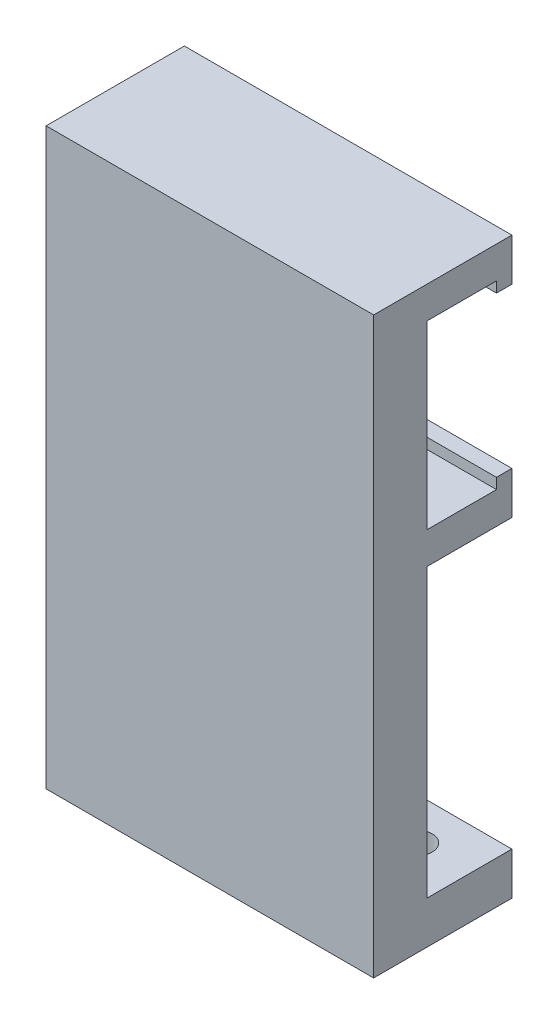
ISO-10303-21;
HEADER;
FILE_DESCRIPTION(('STEP AP214'),'2;1');
FILE_NAME('part.step','',(''),(''),'','','');
FILE_SCHEMA(('AUTOMOTIVE_DESIGN { 1 0 10303 214 1 1 1 1 }'));
ENDSEC;
DATA;
#1=APPLICATION_CONTEXT('core data for automotive mechanical design processes');
#2=APPLICATION_PROTOCOL_DEFINITION('international standard','automotive_design',2000,#1);
#3=PRODUCT_CONTEXT('',#1,'mechanical');
#4=PRODUCT('Part','Part','',(#3));
#5=PRODUCT_RELATED_PRODUCT_CATEGORY('part','',(#4));
#6=PRODUCT_DEFINITION_FORMATION('','',#4);
#7=PRODUCT_DEFINITION_CONTEXT('part definition',#1,'design');
#8=PRODUCT_DEFINITION('design','',#6,#7);
#9=PRODUCT_DEFINITION_SHAPE('','',#8);
#10=(LENGTH_UNIT() NAMED_UNIT(*) SI_UNIT(.MILLI.,.METRE.));
#11=(NAMED_UNIT(*) PLANE_ANGLE_UNIT() SI_UNIT($,.RADIAN.));
#12=(NAMED_UNIT(*) SI_UNIT($,.STERADIAN.) SOLID_ANGLE_UNIT());
#13=UNCERTAINTY_MEASURE_WITH_UNIT(LENGTH_MEASURE(1.E-05),#10,'distance_accuracy_value','');
#14=(GEOMETRIC_REPRESENTATION_CONTEXT(3) GLOBAL_UNCERTAINTY_ASSIGNED_CONTEXT((#13)) GLOBAL_UNIT_ASSIGNED_CONTEXT((#10,
#11,#12)) REPRESENTATION_CONTEXT('',''));
#15=CARTESIAN_POINT('',(0.,0.,0.));
#16=DIRECTION('',(0.,0.,1.));
#17=DIRECTION('',(1.,0.,0.));
#18=AXIS2_PLACEMENT_3D('',#15,#16,#17);
#19=CARTESIAN_POINT('',(0.,0.,0.));
#20=DIRECTION('',(0.,0.,1.));
#21=DIRECTION('',(1.,0.,0.));
#22=AXIS2_PLACEMENT_3D('',#19,#20,#21);
#23=PLANE('',#22);
#24=DIRECTION('',(0.,1.,0.));
#25=VECTOR('',#24,1.);
#26=CARTESIAN_POINT('',(-2.5,-18.,0.));
#27=LINE('',#26,#25);
#28=CARTESIAN_POINT('',(-2.5,-18.,0.));
#29=VERTEX_POINT('',#28);
#30=CARTESIAN_POINT('',(-2.5,4.,0.));
#31=VERTEX_POINT('',#30);
#32=EDGE_CURVE('E412',#29,#31,#27,.T.);
#33=ORIENTED_EDGE('',*,*,#32,.F.);
#34=DIRECTION('',(-1.,0.,0.));
#35=VECTOR('',#34,1.);
#36=CARTESIAN_POINT('',(2.5,-18.,0.));
#37=LINE('',#36,#35);
#38=CARTESIAN_POINT('',(2.5,-18.,0.));
#39=VERTEX_POINT('',#38);
#40=EDGE_CURVE('E410',#39,#29,#37,.T.);
#41=ORIENTED_EDGE('',*,*,#40,.F.);
#42=DIRECTION('',(0.,-1.,0.));
#43=VECTOR('',#42,1.);
#44=CARTESIAN_POINT('',(2.5,-18.,0.));
#45=LINE('',#44,#43);
#46=CARTESIAN_POINT('',(2.5,4.,0.));
#47=VERTEX_POINT('',#46);
#48=EDGE_CURVE('E409',#47,#39,#45,.T.);
#49=ORIENTED_EDGE('',*,*,#48,.F.);
#50=DIRECTION('',(-1.,0.,0.));
#51=VECTOR('',#50,1.);
#52=CARTESIAN_POINT('',(15.4,4.,0.));
#53=LINE('',#52,#51);
#54=CARTESIAN_POINT('',(15.4,4.,0.));
#55=VERTEX_POINT('',#54);
#56=EDGE_CURVE('E197',#55,#47,#53,.T.);
#57=ORIENTED_EDGE('',*,*,#56,.F.);
#58=DIRECTION('',(0.,1.,0.));
#59=VECTOR('',#58,1.);
#60=CARTESIAN_POINT('',(15.4,27.,0.));
#61=LINE('',#60,#59);
#62=CARTESIAN_POINT('',(15.4,-23.,0.));
#63=VERTEX_POINT('',#62);
#64=EDGE_CURVE('E311',#63,#55,#61,.T.);
#65=ORIENTED_EDGE('',*,*,#64,.F.);
#66=DIRECTION('',(1.,0.,0.));
#67=VECTOR('',#66,1.);
#68=CARTESIAN_POINT('',(-15.4,-23.,0.));
#69=LINE('',#68,#67);
#70=CARTESIAN_POINT('',(-15.4,-23.,0.));
#71=VERTEX_POINT('',#70);
#72=EDGE_CURVE('E257',#71,#63,#69,.T.);
#73=ORIENTED_EDGE('',*,*,#72,.F.);
#74=DIRECTION('',(0.,-1.,0.));
#75=VECTOR('',#74,1.);
#76=CARTESIAN_POINT('',(-15.4,27.,0.));
#77=LINE('',#76,#75);
#78=CARTESIAN_POINT('',(-15.4,4.,0.));
#79=VERTEX_POINT('',#78);
#80=EDGE_CURVE('E315',#79,#71,#77,.T.);
#81=ORIENTED_EDGE('',*,*,#80,.F.);
#82=EDGE_CURVE('E62',#31,#79,#53,.T.);
#83=ORIENTED_EDGE('',*,*,#82,.F.);
#84=EDGE_LOOP('',(#33,#41,#49,#57,#65,#73,#81,#83));
#85=FACE_BOUND('',#84,.T.);
#86=ADVANCED_FACE('F39',(#85),#23,.F.);
#87=CARTESIAN_POINT('',(15.4,4.,-8.));
#88=DIRECTION('',(0.,1.,0.));
#89=DIRECTION('',(0.,0.,1.));
#90=AXIS2_PLACEMENT_3D('',#87,#88,#89);
#91=PLANE('',#90);
#92=DIRECTION('',(0.,0.,1.));
#93=VECTOR('',#92,1.);
#94=CARTESIAN_POINT('',(-2.5,4.,-8.));
#95=LINE('',#94,#93);
#96=CARTESIAN_POINT('',(-2.5,4.,-8.));
#97=VERTEX_POINT('',#96);
#98=EDGE_CURVE('E55',#97,#31,#95,.T.);
#99=ORIENTED_EDGE('',*,*,#98,.T.);
#100=ORIENTED_EDGE('',*,*,#82,.T.);
#101=DIRECTION('',(0.,0.,1.));
#102=VECTOR('',#101,1.);
#103=CARTESIAN_POINT('',(-15.4,4.,-8.));
#104=LINE('',#103,#102);
#105=CARTESIAN_POINT('',(-15.4,4.,-8.));
#106=VERTEX_POINT('',#105);
#107=EDGE_CURVE('E205',#106,#79,#104,.T.);
#108=ORIENTED_EDGE('',*,*,#107,.F.);
#109=DIRECTION('',(-1.,0.,0.));
#110=VECTOR('',#109,1.);
#111=CARTESIAN_POINT('',(15.4,4.,-8.));
#112=LINE('',#111,#110);
#113=EDGE_CURVE('E206',#97,#106,#112,.T.);
#114=ORIENTED_EDGE('',*,*,#113,.F.);
#115=EDGE_LOOP('',(#99,#100,#108,#114));
#116=FACE_BOUND('',#115,.T.);
#117=ADVANCED_FACE('F477',(#116),#91,.F.);
#118=DIRECTION('',(0.,0.,1.));
#119=VECTOR('',#118,1.);
#120=CARTESIAN_POINT('',(2.5,4.,-8.));
#121=LINE('',#120,#119);
#122=CARTESIAN_POINT('',(2.5,4.,-8.));
#123=VERTEX_POINT('',#122);
#124=EDGE_CURVE('E180',#123,#47,#121,.T.);
#125=ORIENTED_EDGE('',*,*,#124,.F.);
#126=CARTESIAN_POINT('',(15.4,4.,-8.));
#127=VERTEX_POINT('',#126);
#128=EDGE_CURVE('E195',#127,#123,#112,.T.);
#129=ORIENTED_EDGE('',*,*,#128,.F.);
#130=DIRECTION('',(0.,0.,1.));
#131=VECTOR('',#130,1.);
#132=CARTESIAN_POINT('',(15.4,4.,-8.));
#133=LINE('',#132,#131);
#134=EDGE_CURVE('E210',#127,#55,#133,.T.);
#135=ORIENTED_EDGE('',*,*,#134,.T.);
#136=ORIENTED_EDGE('',*,*,#56,.T.);
#137=EDGE_LOOP('',(#125,#129,#135,#136));
#138=FACE_BOUND('',#137,.T.);
#139=ADVANCED_FACE('F194',(#138),#91,.F.);
#140=CARTESIAN_POINT('',(15.4,24.,-8.));
#141=DIRECTION('',(0.,1.,0.));
#142=DIRECTION('',(0.,0.,1.));
#143=AXIS2_PLACEMENT_3D('',#140,#141,#142);
#144=PLANE('',#143);
#145=DIRECTION('',(-1.,0.,0.));
#146=VECTOR('',#145,1.);
#147=CARTESIAN_POINT('',(15.4,24.,-6.55));
#148=LINE('',#147,#146);
#149=CARTESIAN_POINT('',(15.4,24.,-6.55));
#150=VERTEX_POINT('',#149);
#151=CARTESIAN_POINT('',(-15.4,24.,-6.55));
#152=VERTEX_POINT('',#151);
#153=EDGE_CURVE('E362',#150,#152,#148,.T.);
#154=ORIENTED_EDGE('',*,*,#153,.F.);
#155=DIRECTION('',(0.,0.,1.));
#156=VECTOR('',#155,1.);
#157=CARTESIAN_POINT('',(15.4,24.,-8.));
#158=LINE('',#157,#156);
#159=CARTESIAN_POINT('',(15.4,24.,0.));
#160=VERTEX_POINT('',#159);
#161=EDGE_CURVE('E249',#150,#160,#158,.T.);
#162=ORIENTED_EDGE('',*,*,#161,.T.);
#163=DIRECTION('',(-1.,0.,0.));
#164=VECTOR('',#163,1.);
#165=CARTESIAN_POINT('',(15.4,24.,0.));
#166=LINE('',#165,#164);
#167=CARTESIAN_POINT('',(-15.4,24.,0.));
#168=VERTEX_POINT('',#167);
#169=EDGE_CURVE('E231',#160,#168,#166,.T.);
#170=ORIENTED_EDGE('',*,*,#169,.T.);
#171=DIRECTION('',(0.,0.,1.));
#172=VECTOR('',#171,1.);
#173=CARTESIAN_POINT('',(-15.4,24.,-8.));
#174=LINE('',#173,#172);
#175=EDGE_CURVE('E243',#152,#168,#174,.T.);
#176=ORIENTED_EDGE('',*,*,#175,.F.);
#177=EDGE_LOOP('',(#154,#162,#170,#176));
#178=FACE_BOUND('',#177,.T.);
#179=ADVANCED_FACE('F436',(#178),#144,.F.);
#180=CARTESIAN_POINT('',(15.4,7.,-8.));
#181=DIRECTION('',(0.,-1.,0.));
#182=DIRECTION('',(0.,0.,-1.));
#183=AXIS2_PLACEMENT_3D('',#180,#181,#182);
#184=PLANE('',#183);
#185=DIRECTION('',(1.,0.,0.));
#186=VECTOR('',#185,1.);
#187=CARTESIAN_POINT('',(15.4,7.,-6.55));
#188=LINE('',#187,#186);
#189=CARTESIAN_POINT('',(-15.4,7.,-6.55));
#190=VERTEX_POINT('',#189);
#191=CARTESIAN_POINT('',(15.4,7.,-6.55));
#192=VERTEX_POINT('',#191);
#193=EDGE_CURVE('E367',#190,#192,#188,.T.);
#194=ORIENTED_EDGE('',*,*,#193,.F.);
#195=DIRECTION('',(0.,0.,1.));
#196=VECTOR('',#195,1.);
#197=CARTESIAN_POINT('',(-15.4,7.,-8.));
#198=LINE('',#197,#196);
#199=CARTESIAN_POINT('',(-15.4,7.,0.));
#200=VERTEX_POINT('',#199);
#201=EDGE_CURVE('E228',#190,#200,#198,.T.);
#202=ORIENTED_EDGE('',*,*,#201,.T.);
#203=DIRECTION('',(1.,0.,0.));
#204=VECTOR('',#203,1.);
#205=CARTESIAN_POINT('',(15.4,7.,0.));
#206=LINE('',#205,#204);
#207=CARTESIAN_POINT('',(15.4,7.,0.));
#208=VERTEX_POINT('',#207);
#209=EDGE_CURVE('E215',#200,#208,#206,.T.);
#210=ORIENTED_EDGE('',*,*,#209,.T.);
#211=DIRECTION('',(0.,0.,1.));
#212=VECTOR('',#211,1.);
#213=CARTESIAN_POINT('',(15.4,7.,-8.));
#214=LINE('',#213,#212);
#215=EDGE_CURVE('E225',#192,#208,#214,.T.);
#216=ORIENTED_EDGE('',*,*,#215,.F.);
#217=EDGE_LOOP('',(#194,#202,#210,#216));
#218=FACE_BOUND('',#217,.T.);
#219=ADVANCED_FACE('F446',(#218),#184,.F.);
#220=ORIENTED_EDGE('',*,*,#209,.F.);
#221=EDGE_CURVE('E301',#168,#200,#77,.T.);
#222=ORIENTED_EDGE('',*,*,#221,.F.);
#223=ORIENTED_EDGE('',*,*,#169,.F.);
#224=EDGE_CURVE('E295',#208,#160,#61,.T.);
#225=ORIENTED_EDGE('',*,*,#224,.F.);
#226=EDGE_LOOP('',(#220,#222,#223,#225));
#227=FACE_BOUND('',#226,.T.);
#228=ADVANCED_FACE('F444',(#227),#23,.F.);
#229=CARTESIAN_POINT('',(15.4,27.,5.));
#230=DIRECTION('',(-1.,0.,0.));
#231=DIRECTION('',(0.,-1.,0.));
#232=AXIS2_PLACEMENT_3D('',#229,#230,#231);
#233=PLANE('',#232);
#234=DIRECTION('',(0.,0.,-1.));
#235=VECTOR('',#234,1.);
#236=CARTESIAN_POINT('',(15.4,-27.,5.));
#237=LINE('',#236,#235);
#238=CARTESIAN_POINT('',(15.4,-27.,5.));
#239=VERTEX_POINT('',#238);
#240=CARTESIAN_POINT('',(15.4,-27.,-8.));
#241=VERTEX_POINT('',#240);
#242=EDGE_CURVE('E310',#239,#241,#237,.T.);
#243=ORIENTED_EDGE('',*,*,#242,.T.);
#244=DIRECTION('',(0.,-1.,0.));
#245=VECTOR('',#244,1.);
#246=CARTESIAN_POINT('',(15.4,-27.,-8.));
#247=LINE('',#246,#245);
#248=CARTESIAN_POINT('',(15.4,-23.,-8.));
#249=VERTEX_POINT('',#248);
#250=EDGE_CURVE('E276',#249,#241,#247,.T.);
#251=ORIENTED_EDGE('',*,*,#250,.F.);
#252=DIRECTION('',(0.,0.,1.));
#253=VECTOR('',#252,1.);
#254=CARTESIAN_POINT('',(15.4,-23.,-8.));
#255=LINE('',#254,#253);
#256=EDGE_CURVE('E284',#249,#63,#255,.T.);
#257=ORIENTED_EDGE('',*,*,#256,.T.);
#258=ORIENTED_EDGE('',*,*,#64,.T.);
#259=ORIENTED_EDGE('',*,*,#134,.F.);
#260=DIRECTION('',(0.,-1.,0.));
#261=VECTOR('',#260,1.);
#262=CARTESIAN_POINT('',(15.4,7.,-8.));
#263=LINE('',#262,#261);
#264=CARTESIAN_POINT('',(15.4,8.,-8.));
#265=VERTEX_POINT('',#264);
#266=EDGE_CURVE('E202',#265,#127,#263,.T.);
#267=ORIENTED_EDGE('',*,*,#266,.F.);
#268=DIRECTION('',(0.,0.,-1.));
#269=VECTOR('',#268,1.);
#270=CARTESIAN_POINT('',(15.4,8.,-8.));
#271=LINE('',#270,#269);
#272=CARTESIAN_POINT('',(15.4,8.,-6.55));
#273=VERTEX_POINT('',#272);
#274=EDGE_CURVE('E368',#273,#265,#271,.T.);
#275=ORIENTED_EDGE('',*,*,#274,.F.);
#276=DIRECTION('',(0.,-1.,0.));
#277=VECTOR('',#276,1.);
#278=CARTESIAN_POINT('',(15.4,8.,-6.55));
#279=LINE('',#278,#277);
#280=EDGE_CURVE('E382',#273,#192,#279,.T.);
#281=ORIENTED_EDGE('',*,*,#280,.T.);
#282=ORIENTED_EDGE('',*,*,#215,.T.);
#283=ORIENTED_EDGE('',*,*,#224,.T.);
#284=ORIENTED_EDGE('',*,*,#161,.F.);
#285=DIRECTION('',(0.,1.,0.));
#286=VECTOR('',#285,1.);
#287=CARTESIAN_POINT('',(15.4,23.,-6.55));
#288=LINE('',#287,#286);
#289=CARTESIAN_POINT('',(15.4,23.,-6.55));
#290=VERTEX_POINT('',#289);
#291=EDGE_CURVE('E356',#290,#150,#288,.T.);
#292=ORIENTED_EDGE('',*,*,#291,.F.);
#293=DIRECTION('',(0.,0.,1.));
#294=VECTOR('',#293,1.);
#295=CARTESIAN_POINT('',(15.4,23.,-8.));
#296=LINE('',#295,#294);
#297=CARTESIAN_POINT('',(15.4,23.,-8.));
#298=VERTEX_POINT('',#297);
#299=EDGE_CURVE('E346',#298,#290,#296,.T.);
#300=ORIENTED_EDGE('',*,*,#299,.F.);
#301=DIRECTION('',(0.,-1.,0.));
#302=VECTOR('',#301,1.);
#303=CARTESIAN_POINT('',(15.4,27.,-8.));
#304=LINE('',#303,#302);
#305=CARTESIAN_POINT('',(15.4,27.,-8.));
#306=VERTEX_POINT('',#305);
#307=EDGE_CURVE('E232',#306,#298,#304,.T.);
#308=ORIENTED_EDGE('',*,*,#307,.F.);
#309=DIRECTION('',(0.,0.,-1.));
#310=VECTOR('',#309,1.);
#311=CARTESIAN_POINT('',(15.4,27.,5.));
#312=LINE('',#311,#310);
#313=CARTESIAN_POINT('',(15.4,27.,5.));
#314=VERTEX_POINT('',#313);
#315=EDGE_CURVE('E11',#314,#306,#312,.T.);
#316=ORIENTED_EDGE('',*,*,#315,.F.);
#317=DIRECTION('',(0.,1.,0.));
#318=VECTOR('',#317,1.);
#319=CARTESIAN_POINT('',(15.4,27.,5.));
#320=LINE('',#319,#318);
#321=EDGE_CURVE('E296',#239,#314,#320,.T.);
#322=ORIENTED_EDGE('',*,*,#321,.F.);
#323=EDGE_LOOP('',(#243,#251,#257,#258,#259,#267,#275,#281,#282,#283,#284,#292,#300,#308,#316,#322));
#324=FACE_BOUND('',#323,.T.);
#325=ADVANCED_FACE('F41',(#324),#233,.F.);
#326=CARTESIAN_POINT('',(-15.4,27.,5.));
#327=DIRECTION('',(0.,-1.,0.));
#328=DIRECTION('',(0.,0.,-1.));
#329=AXIS2_PLACEMENT_3D('',#326,#327,#328);
#330=PLANE('',#329);
#331=ORIENTED_EDGE('',*,*,#315,.T.);
#332=DIRECTION('',(1.,0.,0.));
#333=VECTOR('',#332,1.);
#334=CARTESIAN_POINT('',(15.4,27.,-8.));
#335=LINE('',#334,#333);
#336=CARTESIAN_POINT('',(-15.4,27.,-8.));
#337=VERTEX_POINT('',#336);
#338=EDGE_CURVE('E239',#337,#306,#335,.T.);
#339=ORIENTED_EDGE('',*,*,#338,.F.);
#340=DIRECTION('',(0.,0.,-1.));
#341=VECTOR('',#340,1.);
#342=CARTESIAN_POINT('',(-15.4,27.,5.));
#343=LINE('',#342,#341);
#344=CARTESIAN_POINT('',(-15.4,27.,5.));
#345=VERTEX_POINT('',#344);
#346=EDGE_CURVE('E48',#345,#337,#343,.T.);
#347=ORIENTED_EDGE('',*,*,#346,.F.);
#348=DIRECTION('',(-1.,0.,0.));
#349=VECTOR('',#348,1.);
#350=CARTESIAN_POINT('',(-15.4,27.,5.));
#351=LINE('',#350,#349);
#352=EDGE_CURVE('E300',#314,#345,#351,.T.);
#353=ORIENTED_EDGE('',*,*,#352,.F.);
#354=EDGE_LOOP('',(#331,#339,#347,#353));
#355=FACE_BOUND('',#354,.T.);
#356=ADVANCED_FACE('F339',(#355),#330,.F.);
#357=CARTESIAN_POINT('',(-15.4,27.,5.));
#358=DIRECTION('',(1.,0.,0.));
#359=DIRECTION('',(0.,1.,0.));
#360=AXIS2_PLACEMENT_3D('',#357,#358,#359);
#361=PLANE('',#360);
#362=ORIENTED_EDGE('',*,*,#346,.T.);
#363=DIRECTION('',(0.,1.,0.));
#364=VECTOR('',#363,1.);
#365=CARTESIAN_POINT('',(-15.4,27.,-8.));
#366=LINE('',#365,#364);
#367=CARTESIAN_POINT('',(-15.4,23.,-8.));
#368=VERTEX_POINT('',#367);
#369=EDGE_CURVE('E235',#368,#337,#366,.T.);
#370=ORIENTED_EDGE('',*,*,#369,.F.);
#371=DIRECTION('',(0.,0.,-1.));
#372=VECTOR('',#371,1.);
#373=CARTESIAN_POINT('',(-15.4,23.,-8.));
#374=LINE('',#373,#372);
#375=CARTESIAN_POINT('',(-15.4,23.,-6.55));
#376=VERTEX_POINT('',#375);
#377=EDGE_CURVE('E349',#376,#368,#374,.T.);
#378=ORIENTED_EDGE('',*,*,#377,.F.);
#379=DIRECTION('',(0.,1.,0.));
#380=VECTOR('',#379,1.);
#381=CARTESIAN_POINT('',(-15.4,23.,-6.55));
#382=LINE('',#381,#380);
#383=EDGE_CURVE('E351',#376,#152,#382,.T.);
#384=ORIENTED_EDGE('',*,*,#383,.T.);
#385=ORIENTED_EDGE('',*,*,#175,.T.);
#386=ORIENTED_EDGE('',*,*,#221,.T.);
#387=ORIENTED_EDGE('',*,*,#201,.F.);
#388=DIRECTION('',(0.,-1.,0.));
#389=VECTOR('',#388,1.);
#390=CARTESIAN_POINT('',(-15.4,8.,-6.55));
#391=LINE('',#390,#389);
#392=CARTESIAN_POINT('',(-15.4,8.,-6.55));
#393=VERTEX_POINT('',#392);
#394=EDGE_CURVE('E219',#393,#190,#391,.T.);
#395=ORIENTED_EDGE('',*,*,#394,.F.);
#396=DIRECTION('',(0.,0.,1.));
#397=VECTOR('',#396,1.);
#398=CARTESIAN_POINT('',(-15.4,8.,-8.));
#399=LINE('',#398,#397);
#400=CARTESIAN_POINT('',(-15.4,8.,-8.));
#401=VERTEX_POINT('',#400);
#402=EDGE_CURVE('E376',#401,#393,#399,.T.);
#403=ORIENTED_EDGE('',*,*,#402,.F.);
#404=DIRECTION('',(0.,1.,0.));
#405=VECTOR('',#404,1.);
#406=CARTESIAN_POINT('',(-15.4,7.,-8.));
#407=LINE('',#406,#405);
#408=EDGE_CURVE('E221',#106,#401,#407,.T.);
#409=ORIENTED_EDGE('',*,*,#408,.F.);
#410=ORIENTED_EDGE('',*,*,#107,.T.);
#411=ORIENTED_EDGE('',*,*,#80,.T.);
#412=DIRECTION('',(0.,0.,1.));
#413=VECTOR('',#412,1.);
#414=CARTESIAN_POINT('',(-15.4,-23.,-8.));
#415=LINE('',#414,#413);
#416=CARTESIAN_POINT('',(-15.4,-23.,-8.));
#417=VERTEX_POINT('',#416);
#418=EDGE_CURVE('E291',#417,#71,#415,.T.);
#419=ORIENTED_EDGE('',*,*,#418,.F.);
#420=DIRECTION('',(0.,1.,0.));
#421=VECTOR('',#420,1.);
#422=CARTESIAN_POINT('',(-15.4,-27.,-8.));
#423=LINE('',#422,#421);
#424=CARTESIAN_POINT('',(-15.4,-27.,-8.));
#425=VERTEX_POINT('',#424);
#426=EDGE_CURVE('E269',#425,#417,#423,.T.);
#427=ORIENTED_EDGE('',*,*,#426,.F.);
#428=DIRECTION('',(0.,0.,-1.));
#429=VECTOR('',#428,1.);
#430=CARTESIAN_POINT('',(-15.4,-27.,5.));
#431=LINE('',#430,#429);
#432=CARTESIAN_POINT('',(-15.4,-27.,5.));
#433=VERTEX_POINT('',#432);
#434=EDGE_CURVE('E321',#433,#425,#431,.T.);
#435=ORIENTED_EDGE('',*,*,#434,.F.);
#436=DIRECTION('',(0.,-1.,0.));
#437=VECTOR('',#436,1.);
#438=CARTESIAN_POINT('',(-15.4,27.,5.));
#439=LINE('',#438,#437);
#440=EDGE_CURVE('E304',#345,#433,#439,.T.);
#441=ORIENTED_EDGE('',*,*,#440,.F.);
#442=EDGE_LOOP('',(#362,#370,#378,#384,#385,#386,#387,#395,#403,#409,#410,#411,#419,#427,#435,#441));
#443=FACE_BOUND('',#442,.T.);
#444=ADVANCED_FACE('F327',(#443),#361,.F.);
#445=CARTESIAN_POINT('',(-15.4,-27.,5.));
#446=DIRECTION('',(0.,1.,0.));
#447=DIRECTION('',(0.,0.,1.));
#448=AXIS2_PLACEMENT_3D('',#445,#446,#447);
#449=PLANE('',#448);
#450=CARTESIAN_POINT('',(10.4,-27.,-4.));
#451=DIRECTION('',(0.,1.,0.));
#452=DIRECTION('',(-1.,0.,0.));
#453=AXIS2_PLACEMENT_3D('',#450,#451,#452);
#454=CIRCLE('',#453,1.5);
#455=CARTESIAN_POINT('',(8.9,-27.,-4.));
#456=VERTEX_POINT('',#455);
#457=EDGE_CURVE('E253',#456,#456,#454,.T.);
#458=ORIENTED_EDGE('',*,*,#457,.T.);
#459=EDGE_LOOP('',(#458));
#460=FACE_BOUND('',#459,.T.);
#461=CARTESIAN_POINT('',(-10.4,-27.,-4.));
#462=DIRECTION('',(0.,1.,0.));
#463=DIRECTION('',(-1.,0.,0.));
#464=AXIS2_PLACEMENT_3D('',#461,#462,#463);
#465=CIRCLE('',#464,1.5);
#466=CARTESIAN_POINT('',(-11.9,-27.,-4.));
#467=VERTEX_POINT('',#466);
#468=EDGE_CURVE('E262',#467,#467,#465,.T.);
#469=ORIENTED_EDGE('',*,*,#468,.T.);
#470=EDGE_LOOP('',(#469));
#471=FACE_BOUND('',#470,.T.);
#472=ORIENTED_EDGE('',*,*,#434,.T.);
#473=DIRECTION('',(-1.,0.,0.));
#474=VECTOR('',#473,1.);
#475=CARTESIAN_POINT('',(-15.4,-27.,-8.));
#476=LINE('',#475,#474);
#477=EDGE_CURVE('E280',#241,#425,#476,.T.);
#478=ORIENTED_EDGE('',*,*,#477,.F.);
#479=ORIENTED_EDGE('',*,*,#242,.F.);
#480=DIRECTION('',(1.,0.,0.));
#481=VECTOR('',#480,1.);
#482=CARTESIAN_POINT('',(-15.4,-27.,5.));
#483=LINE('',#482,#481);
#484=EDGE_CURVE('E307',#433,#239,#483,.T.);
#485=ORIENTED_EDGE('',*,*,#484,.F.);
#486=EDGE_LOOP('',(#472,#478,#479,#485));
#487=FACE_BOUND('',#486,.T.);
#488=ADVANCED_FACE('F462',(#460,#471,#487),#449,.F.);
#489=CARTESIAN_POINT('',(0.,0.,5.));
#490=DIRECTION('',(0.,0.,1.));
#491=DIRECTION('',(1.,0.,0.));
#492=AXIS2_PLACEMENT_3D('',#489,#490,#491);
#493=PLANE('',#492);
#494=ORIENTED_EDGE('',*,*,#321,.T.);
#495=ORIENTED_EDGE('',*,*,#352,.T.);
#496=ORIENTED_EDGE('',*,*,#440,.T.);
#497=ORIENTED_EDGE('',*,*,#484,.T.);
#498=EDGE_LOOP('',(#494,#495,#496,#497));
#499=FACE_BOUND('',#498,.T.);
#500=ADVANCED_FACE('F464',(#499),#493,.T.);
#501=CARTESIAN_POINT('',(-15.4,-23.,-8.));
#502=DIRECTION('',(0.,-1.,0.));
#503=DIRECTION('',(1.,0.,0.));
#504=AXIS2_PLACEMENT_3D('',#501,#502,#503);
#505=PLANE('',#504);
#506=CARTESIAN_POINT('',(10.4,-23.,-4.));
#507=DIRECTION('',(0.,1.,0.));
#508=DIRECTION('',(-1.,0.,0.));
#509=AXIS2_PLACEMENT_3D('',#506,#507,#508);
#510=CIRCLE('',#509,1.5);
#511=CARTESIAN_POINT('',(8.9,-23.,-4.));
#512=VERTEX_POINT('',#511);
#513=EDGE_CURVE('E258',#512,#512,#510,.T.);
#514=ORIENTED_EDGE('',*,*,#513,.F.);
#515=EDGE_LOOP('',(#514));
#516=FACE_BOUND('',#515,.T.);
#517=CARTESIAN_POINT('',(-10.4,-23.,-4.));
#518=DIRECTION('',(0.,1.,0.));
#519=DIRECTION('',(-1.,0.,0.));
#520=AXIS2_PLACEMENT_3D('',#517,#518,#519);
#521=CIRCLE('',#520,1.5);
#522=CARTESIAN_POINT('',(-11.9,-23.,-4.));
#523=VERTEX_POINT('',#522);
#524=EDGE_CURVE('E252',#523,#523,#521,.T.);
#525=ORIENTED_EDGE('',*,*,#524,.F.);
#526=EDGE_LOOP('',(#525));
#527=FACE_BOUND('',#526,.T.);
#528=ORIENTED_EDGE('',*,*,#72,.T.);
#529=ORIENTED_EDGE('',*,*,#256,.F.);
#530=DIRECTION('',(1.,0.,0.));
#531=VECTOR('',#530,1.);
#532=CARTESIAN_POINT('',(-15.4,-23.,-8.));
#533=LINE('',#532,#531);
#534=EDGE_CURVE('E273',#417,#249,#533,.T.);
#535=ORIENTED_EDGE('',*,*,#534,.F.);
#536=ORIENTED_EDGE('',*,*,#418,.T.);
#537=EDGE_LOOP('',(#528,#529,#535,#536));
#538=FACE_BOUND('',#537,.T.);
#539=ADVANCED_FACE('F454',(#516,#527,#538),#505,.F.);
#540=CARTESIAN_POINT('',(0.,0.,-8.));
#541=DIRECTION('',(0.,0.,-1.));
#542=DIRECTION('',(-1.,0.,0.));
#543=AXIS2_PLACEMENT_3D('',#540,#541,#542);
#544=PLANE('',#543);
#545=ORIENTED_EDGE('',*,*,#426,.T.);
#546=ORIENTED_EDGE('',*,*,#534,.T.);
#547=ORIENTED_EDGE('',*,*,#250,.T.);
#548=ORIENTED_EDGE('',*,*,#477,.T.);
#549=EDGE_LOOP('',(#545,#546,#547,#548));
#550=FACE_BOUND('',#549,.T.);
#551=ADVANCED_FACE('F457',(#550),#544,.T.);
#552=CARTESIAN_POINT('',(-10.4,-27.,-4.));
#553=DIRECTION('',(0.,1.,0.));
#554=DIRECTION('',(-1.,0.,0.));
#555=AXIS2_PLACEMENT_3D('',#552,#553,#554);
#556=CYLINDRICAL_SURFACE('',#555,1.5);
#557=ORIENTED_EDGE('',*,*,#468,.F.);
#558=EDGE_LOOP('',(#557));
#559=FACE_BOUND('',#558,.T.);
#560=ORIENTED_EDGE('',*,*,#524,.T.);
#561=EDGE_LOOP('',(#560));
#562=FACE_BOUND('',#561,.T.);
#563=ADVANCED_FACE('F499',(#559,#562),#556,.F.);
#564=CARTESIAN_POINT('',(10.4,-27.,-4.));
#565=DIRECTION('',(0.,1.,0.));
#566=DIRECTION('',(-1.,0.,0.));
#567=AXIS2_PLACEMENT_3D('',#564,#565,#566);
#568=CYLINDRICAL_SURFACE('',#567,1.5);
#569=ORIENTED_EDGE('',*,*,#457,.F.);
#570=EDGE_LOOP('',(#569));
#571=FACE_BOUND('',#570,.T.);
#572=ORIENTED_EDGE('',*,*,#513,.T.);
#573=EDGE_LOOP('',(#572));
#574=FACE_BOUND('',#573,.T.);
#575=ADVANCED_FACE('F495',(#571,#574),#568,.F.);
#576=CARTESIAN_POINT('',(0.,0.,-8.));
#577=DIRECTION('',(0.,0.,-1.));
#578=DIRECTION('',(-1.,0.,0.));
#579=AXIS2_PLACEMENT_3D('',#576,#577,#578);
#580=PLANE('',#579);
#581=ORIENTED_EDGE('',*,*,#307,.T.);
#582=DIRECTION('',(1.,0.,0.));
#583=VECTOR('',#582,1.);
#584=CARTESIAN_POINT('',(15.4,23.,-8.));
#585=LINE('',#584,#583);
#586=EDGE_CURVE('E338',#368,#298,#585,.T.);
#587=ORIENTED_EDGE('',*,*,#586,.F.);
#588=ORIENTED_EDGE('',*,*,#369,.T.);
#589=ORIENTED_EDGE('',*,*,#338,.T.);
#590=EDGE_LOOP('',(#581,#587,#588,#589));
#591=FACE_BOUND('',#590,.T.);
#592=ADVANCED_FACE('F335',(#591),#580,.T.);
#593=CARTESIAN_POINT('',(0.,0.,-8.));
#594=DIRECTION('',(0.,0.,-1.));
#595=DIRECTION('',(-1.,0.,0.));
#596=AXIS2_PLACEMENT_3D('',#593,#594,#595);
#597=PLANE('',#596);
#598=ORIENTED_EDGE('',*,*,#408,.T.);
#599=DIRECTION('',(-1.,0.,0.));
#600=VECTOR('',#599,1.);
#601=CARTESIAN_POINT('',(15.4,8.,-8.));
#602=LINE('',#601,#600);
#603=EDGE_CURVE('E372',#265,#401,#602,.T.);
#604=ORIENTED_EDGE('',*,*,#603,.F.);
#605=ORIENTED_EDGE('',*,*,#266,.T.);
#606=ORIENTED_EDGE('',*,*,#128,.T.);
#607=DIRECTION('',(0.,-1.,0.));
#608=VECTOR('',#607,1.);
#609=CARTESIAN_POINT('',(2.5,-18.,-8.));
#610=LINE('',#609,#608);
#611=CARTESIAN_POINT('',(2.5,-18.,-8.));
#612=VERTEX_POINT('',#611);
#613=EDGE_CURVE('E177',#123,#612,#610,.T.);
#614=ORIENTED_EDGE('',*,*,#613,.T.);
#615=DIRECTION('',(-1.,0.,0.));
#616=VECTOR('',#615,1.);
#617=CARTESIAN_POINT('',(2.5,-18.,-8.));
#618=LINE('',#617,#616);
#619=CARTESIAN_POINT('',(-2.5,-18.,-8.));
#620=VERTEX_POINT('',#619);
#621=EDGE_CURVE('E188',#612,#620,#618,.T.);
#622=ORIENTED_EDGE('',*,*,#621,.T.);
#623=DIRECTION('',(0.,1.,0.));
#624=VECTOR('',#623,1.);
#625=CARTESIAN_POINT('',(-2.5,-18.,-8.));
#626=LINE('',#625,#624);
#627=EDGE_CURVE('E189',#620,#97,#626,.T.);
#628=ORIENTED_EDGE('',*,*,#627,.T.);
#629=ORIENTED_EDGE('',*,*,#113,.T.);
#630=EDGE_LOOP('',(#598,#604,#605,#606,#614,#622,#628,#629));
#631=FACE_BOUND('',#630,.T.);
#632=ADVANCED_FACE('F200',(#631),#597,.T.);
#633=CARTESIAN_POINT('',(15.4,8.,-6.55));
#634=DIRECTION('',(0.,0.,-1.));
#635=DIRECTION('',(-1.,0.,0.));
#636=AXIS2_PLACEMENT_3D('',#633,#634,#635);
#637=PLANE('',#636);
#638=ORIENTED_EDGE('',*,*,#193,.T.);
#639=ORIENTED_EDGE('',*,*,#280,.F.);
#640=DIRECTION('',(1.,0.,0.));
#641=VECTOR('',#640,1.);
#642=CARTESIAN_POINT('',(15.4,8.,-6.55));
#643=LINE('',#642,#641);
#644=EDGE_CURVE('E379',#393,#273,#643,.T.);
#645=ORIENTED_EDGE('',*,*,#644,.F.);
#646=ORIENTED_EDGE('',*,*,#394,.T.);
#647=EDGE_LOOP('',(#638,#639,#645,#646));
#648=FACE_BOUND('',#647,.T.);
#649=ADVANCED_FACE('F403',(#648),#637,.F.);
#650=CARTESIAN_POINT('',(0.,8.,0.));
#651=DIRECTION('',(0.,-1.,0.));
#652=DIRECTION('',(0.,0.,-1.));
#653=AXIS2_PLACEMENT_3D('',#650,#651,#652);
#654=PLANE('',#653);
#655=ORIENTED_EDGE('',*,*,#274,.T.);
#656=ORIENTED_EDGE('',*,*,#603,.T.);
#657=ORIENTED_EDGE('',*,*,#402,.T.);
#658=ORIENTED_EDGE('',*,*,#644,.T.);
#659=EDGE_LOOP('',(#655,#656,#657,#658));
#660=FACE_BOUND('',#659,.T.);
#661=ADVANCED_FACE('F395',(#660),#654,.F.);
#662=CARTESIAN_POINT('',(15.4,23.,-6.55));
#663=DIRECTION('',(0.,0.,-1.));
#664=DIRECTION('',(-1.,0.,0.));
#665=AXIS2_PLACEMENT_3D('',#662,#663,#664);
#666=PLANE('',#665);
#667=ORIENTED_EDGE('',*,*,#153,.T.);
#668=ORIENTED_EDGE('',*,*,#383,.F.);
#669=DIRECTION('',(-1.,0.,0.));
#670=VECTOR('',#669,1.);
#671=CARTESIAN_POINT('',(15.4,23.,-6.55));
#672=LINE('',#671,#670);
#673=EDGE_CURVE('E358',#290,#376,#672,.T.);
#674=ORIENTED_EDGE('',*,*,#673,.F.);
#675=ORIENTED_EDGE('',*,*,#291,.T.);
#676=EDGE_LOOP('',(#667,#668,#674,#675));
#677=FACE_BOUND('',#676,.T.);
#678=ADVANCED_FACE('F432',(#677),#666,.F.);
#679=CARTESIAN_POINT('',(0.,23.,0.));
#680=DIRECTION('',(0.,-1.,0.));
#681=DIRECTION('',(0.,0.,-1.));
#682=AXIS2_PLACEMENT_3D('',#679,#680,#681);
#683=PLANE('',#682);
#684=ORIENTED_EDGE('',*,*,#299,.T.);
#685=ORIENTED_EDGE('',*,*,#673,.T.);
#686=ORIENTED_EDGE('',*,*,#377,.T.);
#687=ORIENTED_EDGE('',*,*,#586,.T.);
#688=EDGE_LOOP('',(#684,#685,#686,#687));
#689=FACE_BOUND('',#688,.T.);
#690=ADVANCED_FACE('F348',(#689),#683,.T.);
#691=CARTESIAN_POINT('',(-2.5,-18.,-8.));
#692=DIRECTION('',(1.,0.,0.));
#693=DIRECTION('',(0.,0.,-1.));
#694=AXIS2_PLACEMENT_3D('',#691,#692,#693);
#695=PLANE('',#694);
#696=ORIENTED_EDGE('',*,*,#32,.T.);
#697=ORIENTED_EDGE('',*,*,#98,.F.);
#698=ORIENTED_EDGE('',*,*,#627,.F.);
#699=DIRECTION('',(0.,0.,1.));
#700=VECTOR('',#699,1.);
#701=CARTESIAN_POINT('',(-2.5,-18.,-8.));
#702=LINE('',#701,#700);
#703=EDGE_CURVE('E420',#620,#29,#702,.T.);
#704=ORIENTED_EDGE('',*,*,#703,.T.);
#705=EDGE_LOOP('',(#696,#697,#698,#704));
#706=FACE_BOUND('',#705,.T.);
#707=ADVANCED_FACE('F555',(#706),#695,.F.);
#708=CARTESIAN_POINT('',(2.5,-18.,-8.));
#709=DIRECTION('',(-1.,0.,0.));
#710=DIRECTION('',(0.,0.,1.));
#711=AXIS2_PLACEMENT_3D('',#708,#709,#710);
#712=PLANE('',#711);
#713=ORIENTED_EDGE('',*,*,#48,.T.);
#714=DIRECTION('',(0.,0.,1.));
#715=VECTOR('',#714,1.);
#716=CARTESIAN_POINT('',(2.5,-18.,-8.));
#717=LINE('',#716,#715);
#718=EDGE_CURVE('E183',#612,#39,#717,.T.);
#719=ORIENTED_EDGE('',*,*,#718,.F.);
#720=ORIENTED_EDGE('',*,*,#613,.F.);
#721=ORIENTED_EDGE('',*,*,#124,.T.);
#722=EDGE_LOOP('',(#713,#719,#720,#721));
#723=FACE_BOUND('',#722,.T.);
#724=ADVANCED_FACE('F179',(#723),#712,.F.);
#725=CARTESIAN_POINT('',(2.5,-18.,-8.));
#726=DIRECTION('',(0.,1.,0.));
#727=DIRECTION('',(0.,0.,1.));
#728=AXIS2_PLACEMENT_3D('',#725,#726,#727);
#729=PLANE('',#728);
#730=ORIENTED_EDGE('',*,*,#40,.T.);
#731=ORIENTED_EDGE('',*,*,#703,.F.);
#732=ORIENTED_EDGE('',*,*,#621,.F.);
#733=ORIENTED_EDGE('',*,*,#718,.T.);
#734=EDGE_LOOP('',(#730,#731,#732,#733));
#735=FACE_BOUND('',#734,.T.);
#736=ADVANCED_FACE('F567',(#735),#729,.F.);
#737=CLOSED_SHELL('',(#86,#117,#139,#179,#219,#228,#325,#356,#444,#488,#500,#539,#551,#563,#575,
#592,#632,#649,#661,#678,#690,#707,#724,#736));
#738=MANIFOLD_SOLID_BREP('B2',#737);
#739=ADVANCED_BREP_SHAPE_REPRESENTATION('',(#18,#738),#14);
#740=SHAPE_DEFINITION_REPRESENTATION(#9,#739);
ENDSEC;
END-ISO-10303-21;
